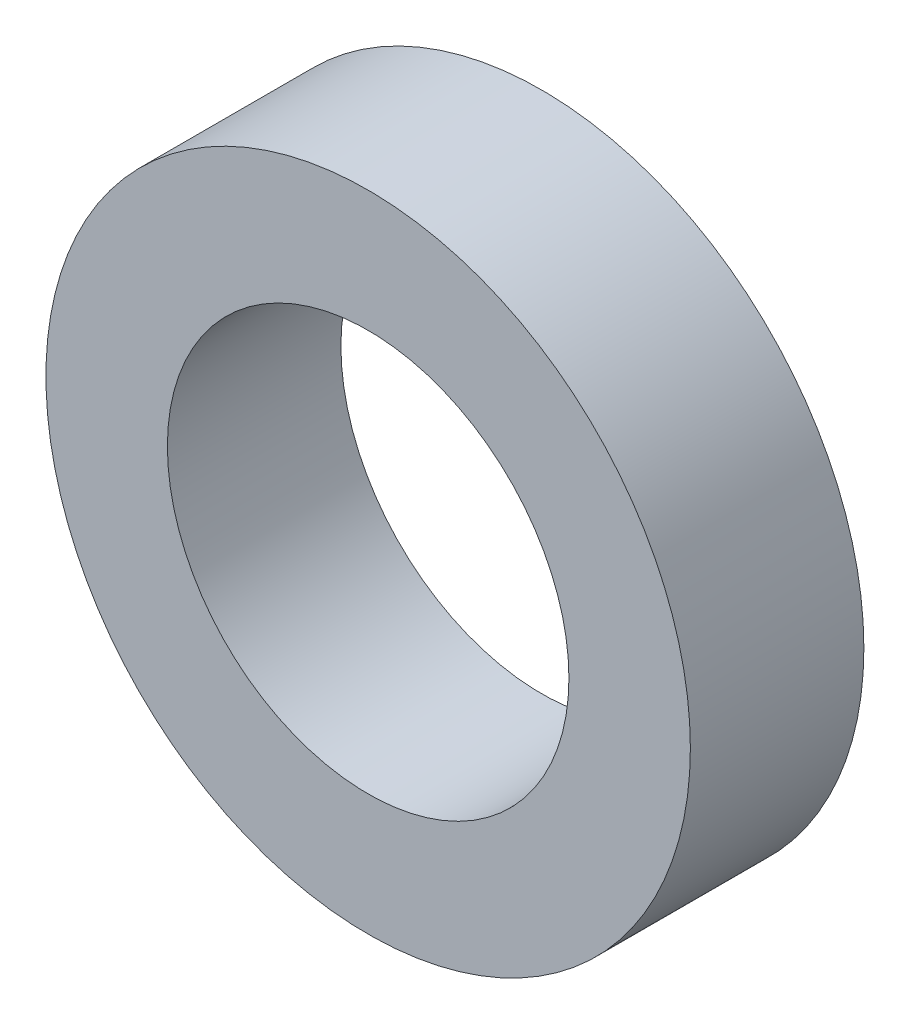
ISO-10303-21;
HEADER;
FILE_DESCRIPTION(('STEP AP214'),'2;1');
FILE_NAME('part.step','',(''),(''),'','','');
FILE_SCHEMA(('AUTOMOTIVE_DESIGN { 1 0 10303 214 1 1 1 1 }'));
ENDSEC;
DATA;
#1=APPLICATION_CONTEXT('core data for automotive mechanical design processes');
#2=APPLICATION_PROTOCOL_DEFINITION('international standard','automotive_design',2000,#1);
#3=PRODUCT_CONTEXT('',#1,'mechanical');
#4=PRODUCT('Part','Part','',(#3));
#5=PRODUCT_RELATED_PRODUCT_CATEGORY('part','',(#4));
#6=PRODUCT_DEFINITION_FORMATION('','',#4);
#7=PRODUCT_DEFINITION_CONTEXT('part definition',#1,'design');
#8=PRODUCT_DEFINITION('design','',#6,#7);
#9=PRODUCT_DEFINITION_SHAPE('','',#8);
#10=(LENGTH_UNIT() NAMED_UNIT(*) SI_UNIT(.MILLI.,.METRE.));
#11=(NAMED_UNIT(*) PLANE_ANGLE_UNIT() SI_UNIT($,.RADIAN.));
#12=(NAMED_UNIT(*) SI_UNIT($,.STERADIAN.) SOLID_ANGLE_UNIT());
#13=UNCERTAINTY_MEASURE_WITH_UNIT(LENGTH_MEASURE(1.E-05),#10,'distance_accuracy_value','');
#14=(GEOMETRIC_REPRESENTATION_CONTEXT(3) GLOBAL_UNCERTAINTY_ASSIGNED_CONTEXT((#13)) GLOBAL_UNIT_ASSIGNED_CONTEXT((#10,
#11,#12)) REPRESENTATION_CONTEXT('',''));
#15=CARTESIAN_POINT('',(0.,0.,0.));
#16=DIRECTION('',(0.,0.,1.));
#17=DIRECTION('',(1.,0.,0.));
#18=AXIS2_PLACEMENT_3D('',#15,#16,#17);
#19=CARTESIAN_POINT('',(0.,0.,7.));
#20=DIRECTION('',(0.,0.,1.));
#21=DIRECTION('',(1.,0.,0.));
#22=AXIS2_PLACEMENT_3D('',#19,#20,#21);
#23=PLANE('',#22);
#24=CARTESIAN_POINT('',(0.,0.,7.));
#25=DIRECTION('',(0.,0.,1.));
#26=DIRECTION('',(1.,0.,0.));
#27=AXIS2_PLACEMENT_3D('',#24,#25,#26);
#28=CIRCLE('',#27,13.);
#29=CARTESIAN_POINT('',(13.,0.,7.));
#30=VERTEX_POINT('',#29);
#31=EDGE_CURVE('E10',#30,#30,#28,.T.);
#32=ORIENTED_EDGE('',*,*,#31,.T.);
#33=EDGE_LOOP('',(#32));
#34=FACE_BOUND('',#33,.T.);
#35=CARTESIAN_POINT('',(0.,0.,7.));
#36=DIRECTION('',(0.,0.,1.));
#37=DIRECTION('',(1.,0.,0.));
#38=AXIS2_PLACEMENT_3D('',#35,#36,#37);
#39=CIRCLE('',#38,8.1);
#40=CARTESIAN_POINT('',(8.1,0.,7.));
#41=VERTEX_POINT('',#40);
#42=EDGE_CURVE('E44',#41,#41,#39,.T.);
#43=ORIENTED_EDGE('',*,*,#42,.F.);
#44=EDGE_LOOP('',(#43));
#45=FACE_BOUND('',#44,.T.);
#46=ADVANCED_FACE('F33',(#34,#45),#23,.T.);
#47=CARTESIAN_POINT('',(0.,0.,0.));
#48=DIRECTION('',(0.,0.,1.));
#49=DIRECTION('',(1.,0.,0.));
#50=AXIS2_PLACEMENT_3D('',#47,#48,#49);
#51=PLANE('',#50);
#52=CARTESIAN_POINT('',(0.,0.,0.));
#53=DIRECTION('',(0.,0.,1.));
#54=DIRECTION('',(1.,0.,0.));
#55=AXIS2_PLACEMENT_3D('',#52,#53,#54);
#56=CIRCLE('',#55,13.);
#57=CARTESIAN_POINT('',(13.,0.,0.));
#58=VERTEX_POINT('',#57);
#59=EDGE_CURVE('E37',#58,#58,#56,.T.);
#60=ORIENTED_EDGE('',*,*,#59,.F.);
#61=EDGE_LOOP('',(#60));
#62=FACE_BOUND('',#61,.T.);
#63=CARTESIAN_POINT('',(0.,0.,0.));
#64=DIRECTION('',(0.,0.,1.));
#65=DIRECTION('',(1.,0.,0.));
#66=AXIS2_PLACEMENT_3D('',#63,#64,#65);
#67=CIRCLE('',#66,8.1);
#68=CARTESIAN_POINT('',(8.1,0.,0.));
#69=VERTEX_POINT('',#68);
#70=EDGE_CURVE('E46',#69,#69,#67,.T.);
#71=ORIENTED_EDGE('',*,*,#70,.T.);
#72=EDGE_LOOP('',(#71));
#73=FACE_BOUND('',#72,.T.);
#74=ADVANCED_FACE('F56',(#62,#73),#51,.F.);
#75=CARTESIAN_POINT('',(0.,0.,7.));
#76=DIRECTION('',(0.,0.,-1.));
#77=DIRECTION('',(-1.,0.,0.));
#78=AXIS2_PLACEMENT_3D('',#75,#76,#77);
#79=CYLINDRICAL_SURFACE('',#78,13.);
#80=ORIENTED_EDGE('',*,*,#31,.F.);
#81=EDGE_LOOP('',(#80));
#82=FACE_BOUND('',#81,.T.);
#83=ORIENTED_EDGE('',*,*,#59,.T.);
#84=EDGE_LOOP('',(#83));
#85=FACE_BOUND('',#84,.T.);
#86=ADVANCED_FACE('F35',(#82,#85),#79,.T.);
#87=CARTESIAN_POINT('',(0.,0.,7.));
#88=DIRECTION('',(0.,0.,-1.));
#89=DIRECTION('',(-1.,0.,0.));
#90=AXIS2_PLACEMENT_3D('',#87,#88,#89);
#91=CYLINDRICAL_SURFACE('',#90,8.1);
#92=ORIENTED_EDGE('',*,*,#42,.T.);
#93=EDGE_LOOP('',(#92));
#94=FACE_BOUND('',#93,.T.);
#95=ORIENTED_EDGE('',*,*,#70,.F.);
#96=EDGE_LOOP('',(#95));
#97=FACE_BOUND('',#96,.T.);
#98=ADVANCED_FACE('F52',(#94,#97),#91,.F.);
#99=CLOSED_SHELL('',(#46,#74,#86,#98));
#100=MANIFOLD_SOLID_BREP('B2',#99);
#101=ADVANCED_BREP_SHAPE_REPRESENTATION('',(#18,#100),#14);
#102=SHAPE_DEFINITION_REPRESENTATION(#9,#101);
ENDSEC;
END-ISO-10303-21;
